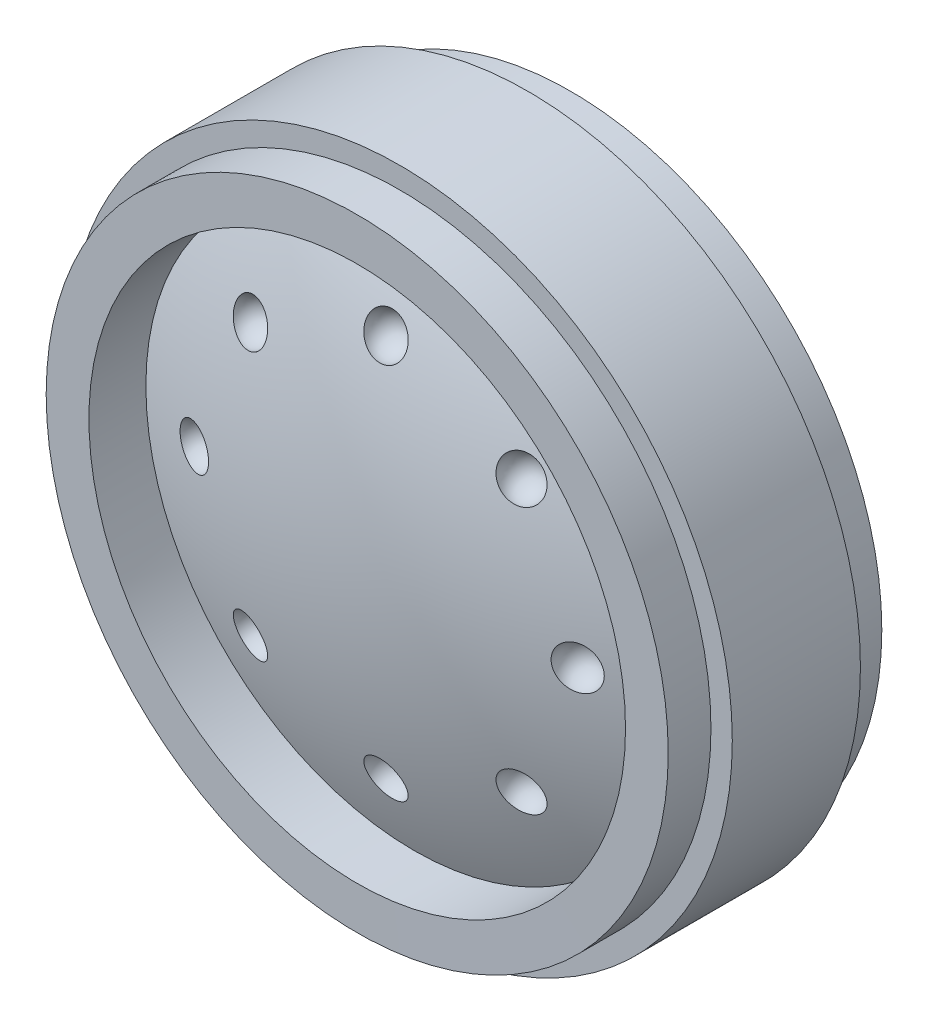
ISO-10303-21;
HEADER;
FILE_DESCRIPTION(('STEP AP214'),'2;1');
FILE_NAME('part.step','',(''),(''),'','','');
FILE_SCHEMA(('AUTOMOTIVE_DESIGN { 1 0 10303 214 1 1 1 1 }'));
ENDSEC;
DATA;
#1=APPLICATION_CONTEXT('core data for automotive mechanical design processes');
#2=APPLICATION_PROTOCOL_DEFINITION('international standard','automotive_design',2000,#1);
#3=PRODUCT_CONTEXT('',#1,'mechanical');
#4=PRODUCT('Part','Part','',(#3));
#5=PRODUCT_RELATED_PRODUCT_CATEGORY('part','',(#4));
#6=PRODUCT_DEFINITION_FORMATION('','',#4);
#7=PRODUCT_DEFINITION_CONTEXT('part definition',#1,'design');
#8=PRODUCT_DEFINITION('design','',#6,#7);
#9=PRODUCT_DEFINITION_SHAPE('','',#8);
#10=(LENGTH_UNIT() NAMED_UNIT(*) SI_UNIT(.MILLI.,.METRE.));
#11=(NAMED_UNIT(*) PLANE_ANGLE_UNIT() SI_UNIT($,.RADIAN.));
#12=(NAMED_UNIT(*) SI_UNIT($,.STERADIAN.) SOLID_ANGLE_UNIT());
#13=UNCERTAINTY_MEASURE_WITH_UNIT(LENGTH_MEASURE(1.E-05),#10,'distance_accuracy_value','');
#14=(GEOMETRIC_REPRESENTATION_CONTEXT(3) GLOBAL_UNCERTAINTY_ASSIGNED_CONTEXT((#13)) GLOBAL_UNIT_ASSIGNED_CONTEXT((#10,
#11,#12)) REPRESENTATION_CONTEXT('',''));
#15=CARTESIAN_POINT('',(0.,0.,0.));
#16=DIRECTION('',(0.,0.,1.));
#17=DIRECTION('',(1.,0.,0.));
#18=AXIS2_PLACEMENT_3D('',#15,#16,#17);
#19=CARTESIAN_POINT('',(0.,0.,31.37027));
#20=DIRECTION('',(0.,0.,1.));
#21=DIRECTION('',(0.,1.,0.));
#22=AXIS2_PLACEMENT_3D('',#19,#20,#21);
#23=SPHERICAL_SURFACE('',#22,37.41928);
#24=CARTESIAN_POINT('',(10.8582515339844,1.15468020423384E-13,-4.41854736604588));
#25=DIRECTION('',(0.290329545202548,0.,-0.95692672404029));
#26=DIRECTION('',(-0.95692672404029,0.,-0.290329545202548));
#27=AXIS2_PLACEMENT_3D('',#24,#25,#26);
#28=CIRCLE('',#27,1.20890069192576);
#29=CARTESIAN_POINT('',(9.70142215516985,1.15468020423384E-13,-4.76952695412773));
#30=VERTEX_POINT('',#29);
#31=EDGE_CURVE('E89',#30,#30,#28,.T.);
#32=ORIENTED_EDGE('',*,*,#31,.F.);
#33=EDGE_LOOP('',(#32));
#34=FACE_BOUND('',#33,.T.);
#35=CARTESIAN_POINT('',(0.,-10.8582515339844,-4.41854736604588));
#36=DIRECTION('',(0.,-0.290329545202548,-0.95692672404029));
#37=DIRECTION('',(0.,0.95692672404029,-0.290329545202548));
#38=AXIS2_PLACEMENT_3D('',#35,#36,#37);
#39=CIRCLE('',#38,1.20890069192576);
#40=CARTESIAN_POINT('',(0.,-9.70142215516985,-4.76952695412773));
#41=VERTEX_POINT('',#40);
#42=EDGE_CURVE('E84',#41,#41,#39,.T.);
#43=ORIENTED_EDGE('',*,*,#42,.F.);
#44=EDGE_LOOP('',(#43));
#45=FACE_BOUND('',#44,.T.);
#46=CARTESIAN_POINT('',(-10.8582515339844,0.,-4.41854736604588));
#47=DIRECTION('',(-0.290329545202548,0.,-0.95692672404029));
#48=DIRECTION('',(-0.95692672404029,0.,0.290329545202548));
#49=AXIS2_PLACEMENT_3D('',#46,#47,#48);
#50=CIRCLE('',#49,1.20890069192576);
#51=CARTESIAN_POINT('',(-12.015080912799,0.,-4.06756777796403));
#52=VERTEX_POINT('',#51);
#53=EDGE_CURVE('E78',#52,#52,#50,.T.);
#54=ORIENTED_EDGE('',*,*,#53,.F.);
#55=EDGE_LOOP('',(#54));
#56=FACE_BOUND('',#55,.T.);
#57=CARTESIAN_POINT('',(0.,10.8582515339844,-4.41854736604588));
#58=DIRECTION('',(0.,0.290329545202548,-0.95692672404029));
#59=DIRECTION('',(0.,0.95692672404029,0.290329545202548));
#60=AXIS2_PLACEMENT_3D('',#57,#58,#59);
#61=CIRCLE('',#60,1.20890069192576);
#62=CARTESIAN_POINT('',(0.,12.015080912799,-4.06756777796403));
#63=VERTEX_POINT('',#62);
#64=EDGE_CURVE('E72',#63,#63,#61,.T.);
#65=ORIENTED_EDGE('',*,*,#64,.F.);
#66=EDGE_LOOP('',(#65));
#67=FACE_BOUND('',#66,.T.);
#68=CARTESIAN_POINT('',(0.,0.,-2.8230330184099));
#69=DIRECTION('',(0.,0.,1.));
#70=DIRECTION('',(1.,0.,0.));
#71=AXIS2_PLACEMENT_3D('',#68,#69,#70);
#72=CIRCLE('',#71,15.19936);
#73=CARTESIAN_POINT('',(15.19936,0.,-2.8230330184099));
#74=VERTEX_POINT('',#73);
#75=EDGE_CURVE('E170',#74,#74,#72,.T.);
#76=ORIENTED_EDGE('',*,*,#75,.F.);
#77=EDGE_LOOP('',(#76));
#78=FACE_BOUND('',#77,.T.);
#79=CARTESIAN_POINT('',(0.,0.,-5.90931));
#80=DIRECTION('',(0.,0.,1.));
#81=DIRECTION('',(1.,0.,0.));
#82=AXIS2_PLACEMENT_3D('',#79,#80,#81);
#83=CIRCLE('',#82,3.23039173197308);
#84=CARTESIAN_POINT('',(3.23039173197308,0.,-5.90931));
#85=VERTEX_POINT('',#84);
#86=EDGE_CURVE('E173',#85,#85,#83,.T.);
#87=ORIENTED_EDGE('',*,*,#86,.T.);
#88=EDGE_LOOP('',(#87));
#89=FACE_BOUND('',#88,.T.);
#90=CARTESIAN_POINT('',(-7.67794329150962,7.6779432915096,-4.41854736604588));
#91=DIRECTION('',(-0.205293990191528,0.205293990191528,-0.95692672404029));
#92=DIRECTION('',(-0.977752509019683,0.,0.209761843779355));
#93=AXIS2_PLACEMENT_3D('',#90,#91,#92);
#94=CIRCLE('',#93,1.20890069192576);
#95=CARTESIAN_POINT('',(-8.85994897619566,7.6779432915096,-4.16496612796139));
#96=VERTEX_POINT('',#95);
#97=EDGE_CURVE('E75',#96,#96,#94,.T.);
#98=ORIENTED_EDGE('',*,*,#97,.F.);
#99=EDGE_LOOP('',(#98));
#100=FACE_BOUND('',#99,.T.);
#101=CARTESIAN_POINT('',(-7.67794329150957,-7.67794329150965,-4.41854736604588));
#102=DIRECTION('',(-0.205293990191527,-0.205293990191529,-0.95692672404029));
#103=DIRECTION('',(0.,0.977752509019683,-0.209761843779356));
#104=AXIS2_PLACEMENT_3D('',#101,#102,#103);
#105=CIRCLE('',#104,1.20890069192576);
#106=CARTESIAN_POINT('',(-7.67794329150957,-6.49593760682361,-4.67212860413036));
#107=VERTEX_POINT('',#106);
#108=EDGE_CURVE('E81',#107,#107,#105,.T.);
#109=ORIENTED_EDGE('',*,*,#108,.F.);
#110=EDGE_LOOP('',(#109));
#111=FACE_BOUND('',#110,.T.);
#112=CARTESIAN_POINT('',(7.67794329150968,-7.67794329150954,-4.41854736604588));
#113=DIRECTION('',(0.20529399019153,-0.205293990191526,-0.95692672404029));
#114=DIRECTION('',(-0.977752509019683,0.,-0.209761843779356));
#115=AXIS2_PLACEMENT_3D('',#112,#113,#114);
#116=CIRCLE('',#115,1.20890069192576);
#117=CARTESIAN_POINT('',(6.49593760682364,-7.67794329150954,-4.67212860413036));
#118=VERTEX_POINT('',#117);
#119=EDGE_CURVE('E87',#118,#118,#116,.T.);
#120=ORIENTED_EDGE('',*,*,#119,.F.);
#121=EDGE_LOOP('',(#120));
#122=FACE_BOUND('',#121,.T.);
#123=CARTESIAN_POINT('',(7.67794329150952,7.6779432915097,-4.41854736604588));
#124=DIRECTION('',(0.205293990191526,0.205293990191531,-0.95692672404029));
#125=DIRECTION('',(0.,0.977752509019682,0.209761843779357));
#126=AXIS2_PLACEMENT_3D('',#123,#124,#125);
#127=CIRCLE('',#126,1.20890069192576);
#128=CARTESIAN_POINT('',(7.67794329150952,8.85994897619574,-4.16496612796139));
#129=VERTEX_POINT('',#128);
#130=EDGE_CURVE('E34',#129,#129,#127,.T.);
#131=ORIENTED_EDGE('',*,*,#130,.F.);
#132=EDGE_LOOP('',(#131));
#133=FACE_BOUND('',#132,.T.);
#134=ADVANCED_FACE('F30',(#34,#45,#56,#67,#78,#89,#100,#111,#122,#133),#23,.T.);
#135=CARTESIAN_POINT('',(0.,0.,-31.37027));
#136=DIRECTION('',(0.,0.,1.));
#137=DIRECTION('',(0.,1.,0.));
#138=AXIS2_PLACEMENT_3D('',#135,#136,#137);
#139=SPHERICAL_SURFACE('',#138,37.41928);
#140=CARTESIAN_POINT('',(10.8582515339844,1.15468020423384E-13,4.41854736604588));
#141=DIRECTION('',(0.290329545202548,0.,0.95692672404029));
#142=DIRECTION('',(0.95692672404029,0.,-0.290329545202548));
#143=AXIS2_PLACEMENT_3D('',#140,#141,#142);
#144=CIRCLE('',#143,1.20890069192576);
#145=CARTESIAN_POINT('',(12.015080912799,1.15468020423384E-13,4.06756777796403));
#146=VERTEX_POINT('',#145);
#147=EDGE_CURVE('E66',#146,#146,#144,.T.);
#148=ORIENTED_EDGE('',*,*,#147,.F.);
#149=EDGE_LOOP('',(#148));
#150=FACE_BOUND('',#149,.T.);
#151=CARTESIAN_POINT('',(0.,-10.8582515339844,4.41854736604588));
#152=DIRECTION('',(0.,-0.290329545202548,0.95692672404029));
#153=DIRECTION('',(0.,-0.95692672404029,-0.290329545202548));
#154=AXIS2_PLACEMENT_3D('',#151,#152,#153);
#155=CIRCLE('',#154,1.20890069192576);
#156=CARTESIAN_POINT('',(0.,-12.015080912799,4.06756777796403));
#157=VERTEX_POINT('',#156);
#158=EDGE_CURVE('E60',#157,#157,#155,.T.);
#159=ORIENTED_EDGE('',*,*,#158,.F.);
#160=EDGE_LOOP('',(#159));
#161=FACE_BOUND('',#160,.T.);
#162=CARTESIAN_POINT('',(-10.8582515339844,0.,4.41854736604588));
#163=DIRECTION('',(-0.290329545202548,0.,0.95692672404029));
#164=DIRECTION('',(0.95692672404029,0.,0.290329545202548));
#165=AXIS2_PLACEMENT_3D('',#162,#163,#164);
#166=CIRCLE('',#165,1.20890069192576);
#167=CARTESIAN_POINT('',(-9.70142215516985,0.,4.76952695412773));
#168=VERTEX_POINT('',#167);
#169=EDGE_CURVE('E54',#168,#168,#166,.T.);
#170=ORIENTED_EDGE('',*,*,#169,.F.);
#171=EDGE_LOOP('',(#170));
#172=FACE_BOUND('',#171,.T.);
#173=CARTESIAN_POINT('',(0.,10.8582515339844,4.41854736604588));
#174=DIRECTION('',(0.,0.290329545202548,0.95692672404029));
#175=DIRECTION('',(0.,-0.95692672404029,0.290329545202548));
#176=AXIS2_PLACEMENT_3D('',#173,#174,#175);
#177=CIRCLE('',#176,1.20890069192576);
#178=CARTESIAN_POINT('',(0.,9.70142215516985,4.76952695412773));
#179=VERTEX_POINT('',#178);
#180=EDGE_CURVE('E47',#179,#179,#177,.T.);
#181=ORIENTED_EDGE('',*,*,#180,.F.);
#182=EDGE_LOOP('',(#181));
#183=FACE_BOUND('',#182,.T.);
#184=CARTESIAN_POINT('',(0.,0.,2.82303301840991));
#185=DIRECTION('',(0.,0.,1.));
#186=DIRECTION('',(1.,0.,0.));
#187=AXIS2_PLACEMENT_3D('',#184,#185,#186);
#188=CIRCLE('',#187,15.19936);
#189=CARTESIAN_POINT('',(15.19936,0.,2.82303301840991));
#190=VERTEX_POINT('',#189);
#191=EDGE_CURVE('E10',#190,#190,#188,.T.);
#192=ORIENTED_EDGE('',*,*,#191,.T.);
#193=EDGE_LOOP('',(#192));
#194=FACE_BOUND('',#193,.T.);
#195=CARTESIAN_POINT('',(-7.67794329150962,7.6779432915096,4.41854736604588));
#196=DIRECTION('',(-0.205293990191528,0.205293990191528,0.95692672404029));
#197=DIRECTION('',(0.977752509019683,0.,0.209761843779355));
#198=AXIS2_PLACEMENT_3D('',#195,#196,#197);
#199=CIRCLE('',#198,1.20890069192576);
#200=CARTESIAN_POINT('',(-6.49593760682358,7.6779432915096,4.67212860413036));
#201=VERTEX_POINT('',#200);
#202=EDGE_CURVE('E51',#201,#201,#199,.T.);
#203=ORIENTED_EDGE('',*,*,#202,.F.);
#204=EDGE_LOOP('',(#203));
#205=FACE_BOUND('',#204,.T.);
#206=CARTESIAN_POINT('',(-7.67794329150957,-7.67794329150965,4.41854736604588));
#207=DIRECTION('',(-0.205293990191527,-0.205293990191529,0.95692672404029));
#208=DIRECTION('',(0.,-0.977752509019683,-0.209761843779356));
#209=AXIS2_PLACEMENT_3D('',#206,#207,#208);
#210=CIRCLE('',#209,1.20890069192576);
#211=CARTESIAN_POINT('',(-7.67794329150957,-8.85994897619569,4.16496612796139));
#212=VERTEX_POINT('',#211);
#213=EDGE_CURVE('E57',#212,#212,#210,.T.);
#214=ORIENTED_EDGE('',*,*,#213,.F.);
#215=EDGE_LOOP('',(#214));
#216=FACE_BOUND('',#215,.T.);
#217=CARTESIAN_POINT('',(7.67794329150968,-7.67794329150954,4.41854736604588));
#218=DIRECTION('',(0.20529399019153,-0.205293990191526,0.95692672404029));
#219=DIRECTION('',(0.977752509019683,0.,-0.209761843779356));
#220=AXIS2_PLACEMENT_3D('',#217,#218,#219);
#221=CIRCLE('',#220,1.20890069192576);
#222=CARTESIAN_POINT('',(8.85994897619572,-7.67794329150954,4.16496612796139));
#223=VERTEX_POINT('',#222);
#224=EDGE_CURVE('E63',#223,#223,#221,.T.);
#225=ORIENTED_EDGE('',*,*,#224,.F.);
#226=EDGE_LOOP('',(#225));
#227=FACE_BOUND('',#226,.T.);
#228=CARTESIAN_POINT('',(7.67794329150952,7.6779432915097,4.41854736604588));
#229=DIRECTION('',(0.205293990191526,0.205293990191531,0.95692672404029));
#230=DIRECTION('',(0.,-0.977752509019682,0.209761843779357));
#231=AXIS2_PLACEMENT_3D('',#228,#229,#230);
#232=CIRCLE('',#231,1.20890069192576);
#233=CARTESIAN_POINT('',(7.67794329150952,6.49593760682366,4.67212860413036));
#234=VERTEX_POINT('',#233);
#235=EDGE_CURVE('E69',#234,#234,#232,.T.);
#236=ORIENTED_EDGE('',*,*,#235,.F.);
#237=EDGE_LOOP('',(#236));
#238=FACE_BOUND('',#237,.T.);
#239=ADVANCED_FACE('F32',(#150,#161,#172,#183,#194,#205,#216,#227,#238),#139,.T.);
#240=CARTESIAN_POINT('',(0.,0.,6.04901));
#241=DIRECTION('',(0.,0.,1.));
#242=DIRECTION('',(1.,0.,0.));
#243=AXIS2_PLACEMENT_3D('',#240,#241,#242);
#244=CYLINDRICAL_SURFACE('',#243,15.19936);
#245=ORIENTED_EDGE('',*,*,#191,.F.);
#246=EDGE_LOOP('',(#245));
#247=FACE_BOUND('',#246,.T.);
#248=CARTESIAN_POINT('',(0.,0.,6.04901));
#249=DIRECTION('',(0.,0.,1.));
#250=DIRECTION('',(1.,0.,0.));
#251=AXIS2_PLACEMENT_3D('',#248,#249,#250);
#252=CIRCLE('',#251,15.19936);
#253=CARTESIAN_POINT('',(15.19936,0.,6.04901));
#254=VERTEX_POINT('',#253);
#255=EDGE_CURVE('E38',#254,#254,#252,.T.);
#256=ORIENTED_EDGE('',*,*,#255,.T.);
#257=EDGE_LOOP('',(#256));
#258=FACE_BOUND('',#257,.T.);
#259=ADVANCED_FACE('F104',(#247,#258),#244,.F.);
#260=CARTESIAN_POINT('',(0.,0.,6.05028));
#261=DIRECTION('',(0.,0.,1.));
#262=DIRECTION('',(1.,0.,0.));
#263=AXIS2_PLACEMENT_3D('',#260,#261,#262);
#264=CONICAL_SURFACE('',#263,17.61998,1.57027166787137);
#265=ORIENTED_EDGE('',*,*,#255,.F.);
#266=EDGE_LOOP('',(#265));
#267=FACE_BOUND('',#266,.T.);
#268=CARTESIAN_POINT('',(0.,0.,6.05028));
#269=DIRECTION('',(0.,0.,1.));
#270=DIRECTION('',(1.,0.,0.));
#271=AXIS2_PLACEMENT_3D('',#268,#269,#270);
#272=CIRCLE('',#271,17.61998);
#273=CARTESIAN_POINT('',(17.61998,0.,6.05028));
#274=VERTEX_POINT('',#273);
#275=EDGE_CURVE('E43',#274,#274,#272,.T.);
#276=ORIENTED_EDGE('',*,*,#275,.T.);
#277=EDGE_LOOP('',(#276));
#278=FACE_BOUND('',#277,.T.);
#279=ADVANCED_FACE('F138',(#267,#278),#264,.F.);
#280=CARTESIAN_POINT('',(0.,0.,6.04901));
#281=DIRECTION('',(0.,0.,1.));
#282=DIRECTION('',(1.,0.,0.));
#283=AXIS2_PLACEMENT_3D('',#280,#281,#282);
#284=CYLINDRICAL_SURFACE('',#283,17.61998);
#285=ORIENTED_EDGE('',*,*,#275,.F.);
#286=EDGE_LOOP('',(#285));
#287=FACE_BOUND('',#286,.T.);
#288=CARTESIAN_POINT('',(0.,0.,3.62966));
#289=DIRECTION('',(0.,0.,1.));
#290=DIRECTION('',(1.,0.,0.));
#291=AXIS2_PLACEMENT_3D('',#288,#289,#290);
#292=CIRCLE('',#291,17.61998);
#293=CARTESIAN_POINT('',(17.61998,0.,3.62966));
#294=VERTEX_POINT('',#293);
#295=EDGE_CURVE('E151',#294,#294,#292,.T.);
#296=ORIENTED_EDGE('',*,*,#295,.T.);
#297=EDGE_LOOP('',(#296));
#298=FACE_BOUND('',#297,.T.);
#299=ADVANCED_FACE('F134',(#287,#298),#284,.T.);
#300=CARTESIAN_POINT('',(0.,18.82902,3.62966));
#301=DIRECTION('',(0.,0.,-1.));
#302=DIRECTION('',(-1.,0.,0.));
#303=AXIS2_PLACEMENT_3D('',#300,#301,#302);
#304=PLANE('',#303);
#305=ORIENTED_EDGE('',*,*,#295,.F.);
#306=EDGE_LOOP('',(#305));
#307=FACE_BOUND('',#306,.T.);
#308=CARTESIAN_POINT('',(0.,0.,3.62966));
#309=DIRECTION('',(0.,0.,1.));
#310=DIRECTION('',(1.,0.,0.));
#311=AXIS2_PLACEMENT_3D('',#308,#309,#310);
#312=CIRCLE('',#311,18.82902);
#313=CARTESIAN_POINT('',(18.82902,0.,3.62966));
#314=VERTEX_POINT('',#313);
#315=EDGE_CURVE('E153',#314,#314,#312,.T.);
#316=ORIENTED_EDGE('',*,*,#315,.T.);
#317=EDGE_LOOP('',(#316));
#318=FACE_BOUND('',#317,.T.);
#319=ADVANCED_FACE('F130',(#307,#318),#304,.F.);
#320=CARTESIAN_POINT('',(0.,0.,6.04901));
#321=DIRECTION('',(0.,0.,1.));
#322=DIRECTION('',(1.,0.,0.));
#323=AXIS2_PLACEMENT_3D('',#320,#321,#322);
#324=CYLINDRICAL_SURFACE('',#323,18.82902);
#325=ORIENTED_EDGE('',*,*,#315,.F.);
#326=EDGE_LOOP('',(#325));
#327=FACE_BOUND('',#326,.T.);
#328=CARTESIAN_POINT('',(0.,0.,-3.62966));
#329=DIRECTION('',(0.,0.,1.));
#330=DIRECTION('',(1.,0.,0.));
#331=AXIS2_PLACEMENT_3D('',#328,#329,#330);
#332=CIRCLE('',#331,18.82902);
#333=CARTESIAN_POINT('',(18.82902,0.,-3.62966));
#334=VERTEX_POINT('',#333);
#335=EDGE_CURVE('E158',#334,#334,#332,.T.);
#336=ORIENTED_EDGE('',*,*,#335,.T.);
#337=EDGE_LOOP('',(#336));
#338=FACE_BOUND('',#337,.T.);
#339=ADVANCED_FACE('F126',(#327,#338),#324,.T.);
#340=CARTESIAN_POINT('',(0.,18.82902,-3.62966));
#341=DIRECTION('',(0.,0.,1.));
#342=DIRECTION('',(1.,0.,0.));
#343=AXIS2_PLACEMENT_3D('',#340,#341,#342);
#344=PLANE('',#343);
#345=ORIENTED_EDGE('',*,*,#335,.F.);
#346=EDGE_LOOP('',(#345));
#347=FACE_BOUND('',#346,.T.);
#348=CARTESIAN_POINT('',(0.,0.,-3.62966));
#349=DIRECTION('',(0.,0.,1.));
#350=DIRECTION('',(1.,0.,0.));
#351=AXIS2_PLACEMENT_3D('',#348,#349,#350);
#352=CIRCLE('',#351,17.61998);
#353=CARTESIAN_POINT('',(17.61998,0.,-3.62966));
#354=VERTEX_POINT('',#353);
#355=EDGE_CURVE('E161',#354,#354,#352,.T.);
#356=ORIENTED_EDGE('',*,*,#355,.T.);
#357=EDGE_LOOP('',(#356));
#358=FACE_BOUND('',#357,.T.);
#359=ADVANCED_FACE('F122',(#347,#358),#344,.F.);
#360=CARTESIAN_POINT('',(0.,0.,6.04901));
#361=DIRECTION('',(0.,0.,1.));
#362=DIRECTION('',(1.,0.,0.));
#363=AXIS2_PLACEMENT_3D('',#360,#361,#362);
#364=CYLINDRICAL_SURFACE('',#363,17.61998);
#365=ORIENTED_EDGE('',*,*,#355,.F.);
#366=EDGE_LOOP('',(#365));
#367=FACE_BOUND('',#366,.T.);
#368=CARTESIAN_POINT('',(0.,0.,-6.05028));
#369=DIRECTION('',(0.,0.,1.));
#370=DIRECTION('',(1.,0.,0.));
#371=AXIS2_PLACEMENT_3D('',#368,#369,#370);
#372=CIRCLE('',#371,17.61998);
#373=CARTESIAN_POINT('',(17.61998,0.,-6.05028));
#374=VERTEX_POINT('',#373);
#375=EDGE_CURVE('E164',#374,#374,#372,.T.);
#376=ORIENTED_EDGE('',*,*,#375,.T.);
#377=EDGE_LOOP('',(#376));
#378=FACE_BOUND('',#377,.T.);
#379=ADVANCED_FACE('F118',(#367,#378),#364,.T.);
#380=CARTESIAN_POINT('',(0.,0.,-6.04901));
#381=DIRECTION('',(0.,0.,-1.));
#382=DIRECTION('',(-1.,0.,0.));
#383=AXIS2_PLACEMENT_3D('',#380,#381,#382);
#384=CONICAL_SURFACE('',#383,15.19936,1.57027166787137);
#385=ORIENTED_EDGE('',*,*,#375,.F.);
#386=EDGE_LOOP('',(#385));
#387=FACE_BOUND('',#386,.T.);
#388=CARTESIAN_POINT('',(0.,0.,-6.04901));
#389=DIRECTION('',(0.,0.,1.));
#390=DIRECTION('',(1.,0.,0.));
#391=AXIS2_PLACEMENT_3D('',#388,#389,#390);
#392=CIRCLE('',#391,15.19936);
#393=CARTESIAN_POINT('',(15.19936,0.,-6.04901));
#394=VERTEX_POINT('',#393);
#395=EDGE_CURVE('E167',#394,#394,#392,.T.);
#396=ORIENTED_EDGE('',*,*,#395,.T.);
#397=EDGE_LOOP('',(#396));
#398=FACE_BOUND('',#397,.T.);
#399=ADVANCED_FACE('F114',(#387,#398),#384,.F.);
#400=CARTESIAN_POINT('',(0.,0.,6.04901));
#401=DIRECTION('',(0.,0.,1.));
#402=DIRECTION('',(1.,0.,0.));
#403=AXIS2_PLACEMENT_3D('',#400,#401,#402);
#404=CYLINDRICAL_SURFACE('',#403,15.19936);
#405=ORIENTED_EDGE('',*,*,#395,.F.);
#406=EDGE_LOOP('',(#405));
#407=FACE_BOUND('',#406,.T.);
#408=ORIENTED_EDGE('',*,*,#75,.T.);
#409=EDGE_LOOP('',(#408));
#410=FACE_BOUND('',#409,.T.);
#411=ADVANCED_FACE('F111',(#407,#410),#404,.F.);
#412=CARTESIAN_POINT('',(0.,0.,6.04901));
#413=DIRECTION('',(0.,0.,1.));
#414=DIRECTION('',(1.,0.,0.));
#415=AXIS2_PLACEMENT_3D('',#412,#413,#414);
#416=CYLINDRICAL_SURFACE('',#415,3.23039173197308);
#417=ORIENTED_EDGE('',*,*,#86,.F.);
#418=EDGE_LOOP('',(#417));
#419=FACE_BOUND('',#418,.T.);
#420=CARTESIAN_POINT('',(0.,0.,0.00127000000000026));
#421=DIRECTION('',(0.,0.,1.));
#422=DIRECTION('',(1.,0.,0.));
#423=AXIS2_PLACEMENT_3D('',#420,#421,#422);
#424=CIRCLE('',#423,3.23039173197308);
#425=CARTESIAN_POINT('',(3.23039173197308,0.,0.00127000000000026));
#426=VERTEX_POINT('',#425);
#427=EDGE_CURVE('E50',#426,#426,#424,.T.);
#428=ORIENTED_EDGE('',*,*,#427,.T.);
#429=EDGE_LOOP('',(#428));
#430=FACE_BOUND('',#429,.T.);
#431=ADVANCED_FACE('F109',(#419,#430),#416,.F.);
#432=CARTESIAN_POINT('',(0.,0.,0.00126999999999993));
#433=DIRECTION('',(0.,0.,1.));
#434=DIRECTION('',(1.,0.,0.));
#435=AXIS2_PLACEMENT_3D('',#432,#433,#434);
#436=PLANE('',#435);
#437=ORIENTED_EDGE('',*,*,#427,.F.);
#438=EDGE_LOOP('',(#437));
#439=FACE_BOUND('',#438,.T.);
#440=ADVANCED_FACE('F180',(#439),#436,.F.);
#441=CARTESIAN_POINT('',(0.,10.86358,4.43611));
#442=DIRECTION('',(-1.,0.,0.));
#443=DIRECTION('',(0.,1.,0.));
#444=AXIS2_PLACEMENT_3D('',#441,#442,#443);
#445=SPHERICAL_SURFACE('',#444,1.20904);
#446=CARTESIAN_POINT('',(0.,10.86358,4.43611));
#447=DIRECTION('',(0.,0.290329545202548,0.95692672404029));
#448=DIRECTION('',(0.,-0.95692672404029,0.290329545202548));
#449=AXIS2_PLACEMENT_3D('',#446,#447,#448);
#450=SPHERICAL_SURFACE('',#449,1.20904);
#451=ORIENTED_EDGE('',*,*,#180,.T.);
#452=EDGE_LOOP('',(#451));
#453=FACE_BOUND('',#452,.T.);
#454=ADVANCED_FACE('F182',(#453),#450,.F.);
#455=CARTESIAN_POINT('',(-7.68171108596257,7.68171108596254,4.43611));
#456=DIRECTION('',(-0.707106781186546,-0.707106781186549,0.));
#457=DIRECTION('',(-0.707106781186549,0.707106781186546,0.));
#458=AXIS2_PLACEMENT_3D('',#455,#456,#457);
#459=SPHERICAL_SURFACE('',#458,1.20904);
#460=CARTESIAN_POINT('',(-7.68171108596257,7.68171108596254,4.43611));
#461=DIRECTION('',(-0.205293990191528,0.205293990191528,0.95692672404029));
#462=DIRECTION('',(0.977752509019683,0.,0.209761843779355));
#463=AXIS2_PLACEMENT_3D('',#460,#461,#462);
#464=SPHERICAL_SURFACE('',#463,1.20904);
#465=ORIENTED_EDGE('',*,*,#202,.T.);
#466=EDGE_LOOP('',(#465));
#467=FACE_BOUND('',#466,.T.);
#468=ADVANCED_FACE('F187',(#467),#464,.F.);
#469=CARTESIAN_POINT('',(-10.86358,0.,4.43611));
#470=DIRECTION('',(0.,-1.,0.));
#471=DIRECTION('',(-1.,0.,0.));
#472=AXIS2_PLACEMENT_3D('',#469,#470,#471);
#473=SPHERICAL_SURFACE('',#472,1.20904);
#474=CARTESIAN_POINT('',(-10.86358,0.,4.43611));
#475=DIRECTION('',(-0.290329545202548,0.,0.95692672404029));
#476=DIRECTION('',(0.95692672404029,0.,0.290329545202548));
#477=AXIS2_PLACEMENT_3D('',#474,#475,#476);
#478=SPHERICAL_SURFACE('',#477,1.20904);
#479=ORIENTED_EDGE('',*,*,#169,.T.);
#480=EDGE_LOOP('',(#479));
#481=FACE_BOUND('',#480,.T.);
#482=ADVANCED_FACE('F194',(#481),#478,.F.);
#483=CARTESIAN_POINT('',(-7.68171108596251,-7.6817110859626,4.43611));
#484=DIRECTION('',(0.707106781186551,-0.707106781186544,0.));
#485=DIRECTION('',(-0.707106781186544,-0.707106781186551,0.));
#486=AXIS2_PLACEMENT_3D('',#483,#484,#485);
#487=SPHERICAL_SURFACE('',#486,1.20904);
#488=CARTESIAN_POINT('',(-7.68171108596251,-7.6817110859626,4.43611));
#489=DIRECTION('',(-0.205293990191527,-0.205293990191529,0.95692672404029));
#490=DIRECTION('',(0.,-0.977752509019683,-0.209761843779356));
#491=AXIS2_PLACEMENT_3D('',#488,#489,#490);
#492=SPHERICAL_SURFACE('',#491,1.20904);
#493=ORIENTED_EDGE('',*,*,#213,.T.);
#494=EDGE_LOOP('',(#493));
#495=FACE_BOUND('',#494,.T.);
#496=ADVANCED_FACE('F198',(#495),#492,.F.);
#497=CARTESIAN_POINT('',(0.,-10.86358,4.43611));
#498=DIRECTION('',(1.,0.,0.));
#499=DIRECTION('',(0.,-1.,0.));
#500=AXIS2_PLACEMENT_3D('',#497,#498,#499);
#501=SPHERICAL_SURFACE('',#500,1.20904);
#502=CARTESIAN_POINT('',(0.,-10.86358,4.43611));
#503=DIRECTION('',(0.,-0.290329545202548,0.95692672404029));
#504=DIRECTION('',(0.,-0.95692672404029,-0.290329545202548));
#505=AXIS2_PLACEMENT_3D('',#502,#503,#504);
#506=SPHERICAL_SURFACE('',#505,1.20904);
#507=ORIENTED_EDGE('',*,*,#158,.T.);
#508=EDGE_LOOP('',(#507));
#509=FACE_BOUND('',#508,.T.);
#510=ADVANCED_FACE('F202',(#509),#506,.F.);
#511=CARTESIAN_POINT('',(7.68171108596262,-7.68171108596249,4.43611));
#512=DIRECTION('',(0.707106781186541,0.707106781186554,0.));
#513=DIRECTION('',(0.707106781186554,-0.707106781186541,0.));
#514=AXIS2_PLACEMENT_3D('',#511,#512,#513);
#515=SPHERICAL_SURFACE('',#514,1.20904);
#516=CARTESIAN_POINT('',(7.68171108596262,-7.68171108596249,4.43611));
#517=DIRECTION('',(0.20529399019153,-0.205293990191526,0.95692672404029));
#518=DIRECTION('',(0.977752509019683,0.,-0.209761843779356));
#519=AXIS2_PLACEMENT_3D('',#516,#517,#518);
#520=SPHERICAL_SURFACE('',#519,1.20904);
#521=ORIENTED_EDGE('',*,*,#224,.T.);
#522=EDGE_LOOP('',(#521));
#523=FACE_BOUND('',#522,.T.);
#524=ADVANCED_FACE('F206',(#523),#520,.F.);
#525=CARTESIAN_POINT('',(10.86358,1.15524684005065E-13,4.43611));
#526=DIRECTION('',(0.,1.,0.));
#527=DIRECTION('',(1.,0.,0.));
#528=AXIS2_PLACEMENT_3D('',#525,#526,#527);
#529=SPHERICAL_SURFACE('',#528,1.20904);
#530=CARTESIAN_POINT('',(10.86358,1.15524684005065E-13,4.43611));
#531=DIRECTION('',(0.290329545202548,0.,0.95692672404029));
#532=DIRECTION('',(0.95692672404029,0.,-0.290329545202548));
#533=AXIS2_PLACEMENT_3D('',#530,#531,#532);
#534=SPHERICAL_SURFACE('',#533,1.20904);
#535=ORIENTED_EDGE('',*,*,#147,.T.);
#536=EDGE_LOOP('',(#535));
#537=FACE_BOUND('',#536,.T.);
#538=ADVANCED_FACE('F210',(#537),#534,.F.);
#539=CARTESIAN_POINT('',(7.68171108596246,7.68171108596265,4.43611));
#540=DIRECTION('',(-0.707106781186556,0.707106781186539,0.));
#541=DIRECTION('',(0.707106781186539,0.707106781186556,0.));
#542=AXIS2_PLACEMENT_3D('',#539,#540,#541);
#543=SPHERICAL_SURFACE('',#542,1.20904);
#544=CARTESIAN_POINT('',(7.68171108596246,7.68171108596265,4.43611));
#545=DIRECTION('',(0.205293990191526,0.205293990191531,0.95692672404029));
#546=DIRECTION('',(0.,-0.977752509019683,0.209761843779357));
#547=AXIS2_PLACEMENT_3D('',#544,#545,#546);
#548=SPHERICAL_SURFACE('',#547,1.20904);
#549=ORIENTED_EDGE('',*,*,#235,.T.);
#550=EDGE_LOOP('',(#549));
#551=FACE_BOUND('',#550,.T.);
#552=ADVANCED_FACE('F214',(#551),#548,.F.);
#553=CARTESIAN_POINT('',(0.,10.86358,-4.43611));
#554=DIRECTION('',(-1.,0.,0.));
#555=DIRECTION('',(0.,1.,0.));
#556=AXIS2_PLACEMENT_3D('',#553,#554,#555);
#557=SPHERICAL_SURFACE('',#556,1.20904);
#558=CARTESIAN_POINT('',(0.,10.86358,-4.43611));
#559=DIRECTION('',(0.,0.290329545202548,-0.95692672404029));
#560=DIRECTION('',(0.,0.95692672404029,0.290329545202548));
#561=AXIS2_PLACEMENT_3D('',#558,#559,#560);
#562=SPHERICAL_SURFACE('',#561,1.20904);
#563=ORIENTED_EDGE('',*,*,#64,.T.);
#564=EDGE_LOOP('',(#563));
#565=FACE_BOUND('',#564,.T.);
#566=ADVANCED_FACE('F218',(#565),#562,.F.);
#567=CARTESIAN_POINT('',(-7.68171108596257,7.68171108596254,-4.43611));
#568=DIRECTION('',(-0.707106781186546,-0.707106781186549,0.));
#569=DIRECTION('',(-0.707106781186549,0.707106781186546,0.));
#570=AXIS2_PLACEMENT_3D('',#567,#568,#569);
#571=SPHERICAL_SURFACE('',#570,1.20904);
#572=CARTESIAN_POINT('',(-7.68171108596257,7.68171108596254,-4.43611));
#573=DIRECTION('',(-0.205293990191528,0.205293990191528,-0.95692672404029));
#574=DIRECTION('',(-0.977752509019683,0.,0.209761843779355));
#575=AXIS2_PLACEMENT_3D('',#572,#573,#574);
#576=SPHERICAL_SURFACE('',#575,1.20904);
#577=ORIENTED_EDGE('',*,*,#97,.T.);
#578=EDGE_LOOP('',(#577));
#579=FACE_BOUND('',#578,.T.);
#580=ADVANCED_FACE('F222',(#579),#576,.F.);
#581=CARTESIAN_POINT('',(-10.86358,0.,-4.43611));
#582=DIRECTION('',(0.,-1.,0.));
#583=DIRECTION('',(-1.,0.,0.));
#584=AXIS2_PLACEMENT_3D('',#581,#582,#583);
#585=SPHERICAL_SURFACE('',#584,1.20904);
#586=CARTESIAN_POINT('',(-10.86358,0.,-4.43611));
#587=DIRECTION('',(-0.290329545202548,0.,-0.95692672404029));
#588=DIRECTION('',(-0.95692672404029,0.,0.290329545202548));
#589=AXIS2_PLACEMENT_3D('',#586,#587,#588);
#590=SPHERICAL_SURFACE('',#589,1.20904);
#591=ORIENTED_EDGE('',*,*,#53,.T.);
#592=EDGE_LOOP('',(#591));
#593=FACE_BOUND('',#592,.T.);
#594=ADVANCED_FACE('F226',(#593),#590,.F.);
#595=CARTESIAN_POINT('',(-7.68171108596251,-7.6817110859626,-4.43611));
#596=DIRECTION('',(0.707106781186551,-0.707106781186544,0.));
#597=DIRECTION('',(-0.707106781186544,-0.707106781186551,0.));
#598=AXIS2_PLACEMENT_3D('',#595,#596,#597);
#599=SPHERICAL_SURFACE('',#598,1.20904);
#600=CARTESIAN_POINT('',(-7.68171108596251,-7.6817110859626,-4.43611));
#601=DIRECTION('',(-0.205293990191527,-0.205293990191529,-0.95692672404029));
#602=DIRECTION('',(0.,0.977752509019683,-0.209761843779356));
#603=AXIS2_PLACEMENT_3D('',#600,#601,#602);
#604=SPHERICAL_SURFACE('',#603,1.20904);
#605=ORIENTED_EDGE('',*,*,#108,.T.);
#606=EDGE_LOOP('',(#605));
#607=FACE_BOUND('',#606,.T.);
#608=ADVANCED_FACE('F230',(#607),#604,.F.);
#609=CARTESIAN_POINT('',(0.,-10.86358,-4.43611));
#610=DIRECTION('',(1.,0.,0.));
#611=DIRECTION('',(0.,-1.,0.));
#612=AXIS2_PLACEMENT_3D('',#609,#610,#611);
#613=SPHERICAL_SURFACE('',#612,1.20904);
#614=CARTESIAN_POINT('',(0.,-10.86358,-4.43611));
#615=DIRECTION('',(0.,-0.290329545202548,-0.95692672404029));
#616=DIRECTION('',(0.,0.95692672404029,-0.290329545202548));
#617=AXIS2_PLACEMENT_3D('',#614,#615,#616);
#618=SPHERICAL_SURFACE('',#617,1.20904);
#619=ORIENTED_EDGE('',*,*,#42,.T.);
#620=EDGE_LOOP('',(#619));
#621=FACE_BOUND('',#620,.T.);
#622=ADVANCED_FACE('F234',(#621),#618,.F.);
#623=CARTESIAN_POINT('',(7.68171108596262,-7.68171108596249,-4.43611));
#624=DIRECTION('',(0.707106781186541,0.707106781186554,0.));
#625=DIRECTION('',(0.707106781186554,-0.707106781186541,0.));
#626=AXIS2_PLACEMENT_3D('',#623,#624,#625);
#627=SPHERICAL_SURFACE('',#626,1.20904);
#628=CARTESIAN_POINT('',(7.68171108596262,-7.68171108596249,-4.43611));
#629=DIRECTION('',(0.20529399019153,-0.205293990191526,-0.95692672404029));
#630=DIRECTION('',(-0.977752509019683,0.,-0.209761843779356));
#631=AXIS2_PLACEMENT_3D('',#628,#629,#630);
#632=SPHERICAL_SURFACE('',#631,1.20904);
#633=ORIENTED_EDGE('',*,*,#119,.T.);
#634=EDGE_LOOP('',(#633));
#635=FACE_BOUND('',#634,.T.);
#636=ADVANCED_FACE('F238',(#635),#632,.F.);
#637=CARTESIAN_POINT('',(10.86358,1.15524684005065E-13,-4.43611));
#638=DIRECTION('',(0.,1.,0.));
#639=DIRECTION('',(1.,0.,0.));
#640=AXIS2_PLACEMENT_3D('',#637,#638,#639);
#641=SPHERICAL_SURFACE('',#640,1.20904);
#642=CARTESIAN_POINT('',(10.86358,1.15524684005065E-13,-4.43611));
#643=DIRECTION('',(0.290329545202548,0.,-0.95692672404029));
#644=DIRECTION('',(-0.95692672404029,0.,-0.290329545202548));
#645=AXIS2_PLACEMENT_3D('',#642,#643,#644);
#646=SPHERICAL_SURFACE('',#645,1.20904);
#647=ORIENTED_EDGE('',*,*,#31,.T.);
#648=EDGE_LOOP('',(#647));
#649=FACE_BOUND('',#648,.T.);
#650=ADVANCED_FACE('F242',(#649),#646,.F.);
#651=CARTESIAN_POINT('',(7.68171108596246,7.68171108596265,-4.43611));
#652=DIRECTION('',(-0.707106781186556,0.707106781186539,0.));
#653=DIRECTION('',(0.707106781186539,0.707106781186556,0.));
#654=AXIS2_PLACEMENT_3D('',#651,#652,#653);
#655=SPHERICAL_SURFACE('',#654,1.20904);
#656=CARTESIAN_POINT('',(7.68171108596246,7.68171108596265,-4.43611));
#657=DIRECTION('',(0.205293990191526,0.205293990191531,-0.95692672404029));
#658=DIRECTION('',(0.,0.977752509019683,0.209761843779357));
#659=AXIS2_PLACEMENT_3D('',#656,#657,#658);
#660=SPHERICAL_SURFACE('',#659,1.20904);
#661=ORIENTED_EDGE('',*,*,#130,.T.);
#662=EDGE_LOOP('',(#661));
#663=FACE_BOUND('',#662,.T.);
#664=ADVANCED_FACE('F96',(#663),#660,.F.);
#665=CLOSED_SHELL('',(#134,#239,#259,#279,#299,#319,#339,#359,#379,#399,#411,#431,#440,#454,
#468,#482,#496,#510,#524,#538,#552,#566,#580,#594,#608,#622,#636,#650,#664));
#666=MANIFOLD_SOLID_BREP('B2',#665);
#667=ADVANCED_BREP_SHAPE_REPRESENTATION('',(#18,#666),#14);
#668=SHAPE_DEFINITION_REPRESENTATION(#9,#667);
ENDSEC;
END-ISO-10303-21;
